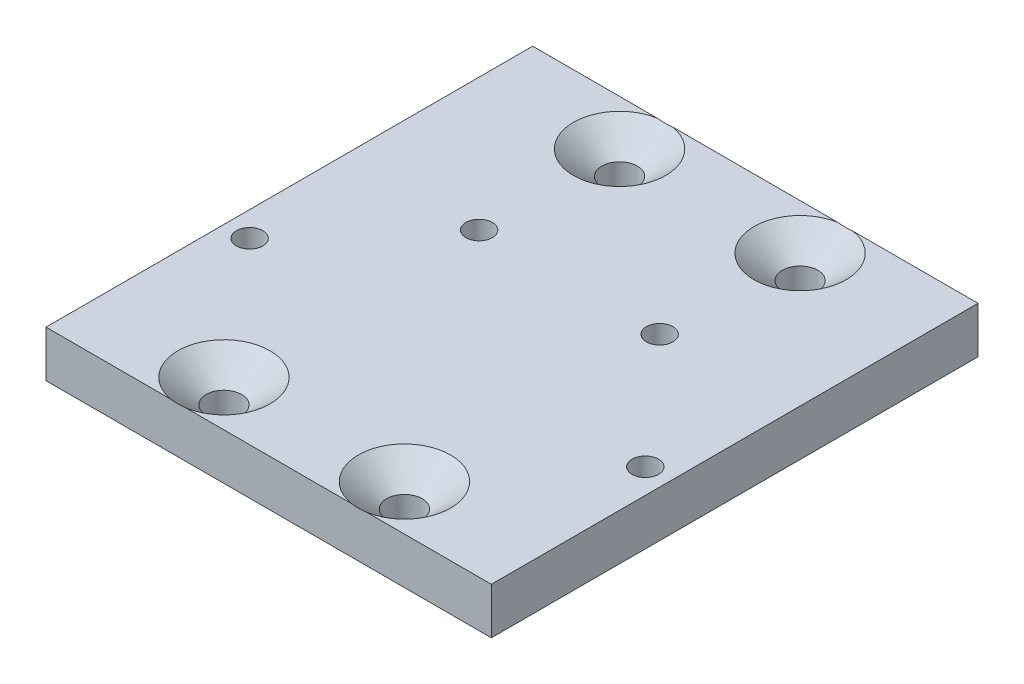
ISO-10303-21;
HEADER;
FILE_DESCRIPTION(('STEP AP214'),'2;1');
FILE_NAME('part.step','',(''),(''),'','','');
FILE_SCHEMA(('AUTOMOTIVE_DESIGN { 1 0 10303 214 1 1 1 1 }'));
ENDSEC;
DATA;
#1=APPLICATION_CONTEXT('core data for automotive mechanical design processes');
#2=APPLICATION_PROTOCOL_DEFINITION('international standard','automotive_design',2000,#1);
#3=PRODUCT_CONTEXT('',#1,'mechanical');
#4=PRODUCT('Part','Part','',(#3));
#5=PRODUCT_RELATED_PRODUCT_CATEGORY('part','',(#4));
#6=PRODUCT_DEFINITION_FORMATION('','',#4);
#7=PRODUCT_DEFINITION_CONTEXT('part definition',#1,'design');
#8=PRODUCT_DEFINITION('design','',#6,#7);
#9=PRODUCT_DEFINITION_SHAPE('','',#8);
#10=(LENGTH_UNIT() NAMED_UNIT(*) SI_UNIT(.MILLI.,.METRE.));
#11=(NAMED_UNIT(*) PLANE_ANGLE_UNIT() SI_UNIT($,.RADIAN.));
#12=(NAMED_UNIT(*) SI_UNIT($,.STERADIAN.) SOLID_ANGLE_UNIT());
#13=UNCERTAINTY_MEASURE_WITH_UNIT(LENGTH_MEASURE(1.E-05),#10,'distance_accuracy_value','');
#14=(GEOMETRIC_REPRESENTATION_CONTEXT(3) GLOBAL_UNCERTAINTY_ASSIGNED_CONTEXT((#13)) GLOBAL_UNIT_ASSIGNED_CONTEXT((#10,
#11,#12)) REPRESENTATION_CONTEXT('',''));
#15=CARTESIAN_POINT('',(0.,0.,0.));
#16=DIRECTION('',(0.,0.,1.));
#17=DIRECTION('',(1.,0.,0.));
#18=AXIS2_PLACEMENT_3D('',#15,#16,#17);
#19=CARTESIAN_POINT('',(-1573.83247517424,-1995.2375,-2973.3422592993));
#20=DIRECTION('',(1.,0.,0.));
#21=DIRECTION('',(0.,0.,-1.));
#22=AXIS2_PLACEMENT_3D('',#19,#20,#21);
#23=PLANE('',#22);
#24=DIRECTION('',(0.,0.,1.));
#25=VECTOR('',#24,1.);
#26=CARTESIAN_POINT('',(-1573.83247517424,-2000.,-2973.3422592993));
#27=LINE('',#26,#25);
#28=CARTESIAN_POINT('',(-1573.83247517424,-2000.,-2973.3422592993));
#29=VERTEX_POINT('',#28);
#30=CARTESIAN_POINT('',(-1573.83247517424,-2000.,-2923.3550592993));
#31=VERTEX_POINT('',#30);
#32=EDGE_CURVE('E186',#29,#31,#27,.T.);
#33=ORIENTED_EDGE('',*,*,#32,.T.);
#34=DIRECTION('',(0.,-1.,0.));
#35=VECTOR('',#34,1.);
#36=CARTESIAN_POINT('',(-1573.83247517424,-1995.2375,-2923.3550592993));
#37=LINE('',#36,#35);
#38=CARTESIAN_POINT('',(-1573.83247517424,-1995.2375,-2923.3550592993));
#39=VERTEX_POINT('',#38);
#40=EDGE_CURVE('E139',#39,#31,#37,.T.);
#41=ORIENTED_EDGE('',*,*,#40,.F.);
#42=DIRECTION('',(0.,0.,1.));
#43=VECTOR('',#42,1.);
#44=CARTESIAN_POINT('',(-1573.83247517424,-1995.2375,-2973.3422592993));
#45=LINE('',#44,#43);
#46=CARTESIAN_POINT('',(-1573.83247517424,-1995.2375,-2973.3422592993));
#47=VERTEX_POINT('',#46);
#48=EDGE_CURVE('E199',#47,#39,#45,.T.);
#49=ORIENTED_EDGE('',*,*,#48,.F.);
#50=DIRECTION('',(0.,-1.,0.));
#51=VECTOR('',#50,1.);
#52=CARTESIAN_POINT('',(-1573.83247517424,-1995.2375,-2973.3422592993));
#53=LINE('',#52,#51);
#54=EDGE_CURVE('E115',#47,#29,#53,.T.);
#55=ORIENTED_EDGE('',*,*,#54,.T.);
#56=EDGE_LOOP('',(#33,#41,#49,#55));
#57=FACE_BOUND('',#56,.T.);
#58=ADVANCED_FACE('F33',(#57),#23,.F.);
#59=CARTESIAN_POINT('',(-1573.83247517424,-1995.2375,-2923.3550592993));
#60=DIRECTION('',(0.,0.,-1.));
#61=DIRECTION('',(0.,1.,0.));
#62=AXIS2_PLACEMENT_3D('',#59,#60,#61);
#63=PLANE('',#62);
#64=DIRECTION('',(1.,0.,0.));
#65=VECTOR('',#64,1.);
#66=CARTESIAN_POINT('',(-1573.83247517424,-1995.2375,-2923.3550592993));
#67=LINE('',#66,#65);
#68=CARTESIAN_POINT('',(-1559.47015970523,-1995.2375,-2923.3550592993));
#69=VERTEX_POINT('',#68);
#70=CARTESIAN_POINT('',(-1542.44896440546,-1995.2375,-2923.3550592993));
#71=VERTEX_POINT('',#70);
#72=EDGE_CURVE('E203',#69,#71,#67,.T.);
#73=ORIENTED_EDGE('',*,*,#72,.F.);
#74=CARTESIAN_POINT('',(-1569.41358530349,-1990.56468048699,-2923.3550592993));
#75=CARTESIAN_POINT('',(-1569.21174421355,-1990.71560274366,-2923.3550592993));
#76=CARTESIAN_POINT('',(-1569.00942688799,-1990.86589320793,-2923.3550592993));
#77=CARTESIAN_POINT('',(-1568.60361527126,-1991.16490288206,-2923.3550592993));
#78=CARTESIAN_POINT('',(-1568.40012090627,-1991.31362199168,-2923.3550592993));
#79=CARTESIAN_POINT('',(-1567.99127915434,-1991.60950735567,-2923.3550592993));
#80=CARTESIAN_POINT('',(-1567.7859285486,-1991.75666916953,-2923.3550592993));
#81=CARTESIAN_POINT('',(-1567.37356854599,-1992.04864333607,-2923.3550592993));
#82=CARTESIAN_POINT('',(-1567.16655918772,-1992.19345574321,-2923.3550592993));
#83=CARTESIAN_POINT('',(-1566.74041587053,-1992.48713154743,-2923.3550592993));
#84=CARTESIAN_POINT('',(-1566.52118161438,-1992.6358497683,-2923.3550592993));
#85=CARTESIAN_POINT('',(-1566.07998760759,-1992.92918361001,-2923.3550592993));
#86=CARTESIAN_POINT('',(-1565.85802795152,-1993.07379937263,-2923.3550592993));
#87=CARTESIAN_POINT('',(-1565.41091390647,-1993.35756803673,-2923.3550592993));
#88=CARTESIAN_POINT('',(-1565.18576262875,-1993.49672581889,-2923.3550592993));
#89=CARTESIAN_POINT('',(-1564.73125197191,-1993.76795927597,-2923.3550592993));
#90=CARTESIAN_POINT('',(-1564.50189323368,-1993.90003601765,-2923.3550592993));
#91=CARTESIAN_POINT('',(-1564.04202878071,-1994.15236184947,-2923.3550592993));
#92=CARTESIAN_POINT('',(-1563.8116165971,-1994.27277996439,-2923.3550592993));
#93=CARTESIAN_POINT('',(-1563.34441558204,-1994.5010589324,-2923.3550592993));
#94=CARTESIAN_POINT('',(-1563.10762350435,-1994.60891323829,-2923.3550592993));
#95=CARTESIAN_POINT('',(-1562.6295392873,-1994.80602783005,-2923.3550592993));
#96=CARTESIAN_POINT('',(-1562.38833179826,-1994.89549023697,-2923.3550592993));
#97=CARTESIAN_POINT('',(-1561.89861100487,-1995.05109294031,-2923.3550592993));
#98=CARTESIAN_POINT('',(-1561.65010945367,-1995.11726874052,-2923.3550592993));
#99=CARTESIAN_POINT('',(-1561.29331100866,-1995.18987244124,-2923.3550592993));
#100=CARTESIAN_POINT('',(-1561.18748172429,-1995.20867064129,-2923.3550592993));
#101=CARTESIAN_POINT('',(-1560.97485251813,-1995.24061926715,-2923.3550592993));
#102=CARTESIAN_POINT('',(-1560.86805168783,-1995.25376369635,-2923.3550592993));
#103=CARTESIAN_POINT('',(-1560.60223798858,-1995.27890725842,-2923.3550592993));
#104=CARTESIAN_POINT('',(-1560.44286670045,-1995.28730184813,-2923.3550592993));
#105=CARTESIAN_POINT('',(-1560.12394991867,-1995.29033100045,-2923.3550592993));
#106=CARTESIAN_POINT('',(-1559.96440438489,-1995.28496101989,-2923.3550592993));
#107=CARTESIAN_POINT('',(-1559.64612845217,-1995.2607655726,-2923.3550592993));
#108=CARTESIAN_POINT('',(-1559.48739948185,-1995.24192154857,-2923.3550592993));
#109=CARTESIAN_POINT('',(-1559.17193971469,-1995.19182549488,-2923.3550592993));
#110=CARTESIAN_POINT('',(-1559.01520908869,-1995.1605724115,-2923.3550592993));
#111=CARTESIAN_POINT('',(-1558.60877570773,-1995.06458512429,-2923.3550592993));
#112=CARTESIAN_POINT('',(-1558.36114591104,-1994.99107930825,-2923.3550592993));
#113=CARTESIAN_POINT('',(-1557.87334822123,-1994.82247643454,-2923.3550592993));
#114=CARTESIAN_POINT('',(-1557.63318724683,-1994.72735999771,-2923.3550592993));
#115=CARTESIAN_POINT('',(-1557.27670875501,-1994.57224914023,-2923.3550592993));
#116=CARTESIAN_POINT('',(-1557.15778713767,-1994.51809897009,-2923.3550592993));
#117=CARTESIAN_POINT('',(-1556.92157463086,-1994.40634088791,-2923.3550592993));
#118=CARTESIAN_POINT('',(-1556.80428376328,-1994.3487329295,-2923.3550592993));
#119=CARTESIAN_POINT('',(-1556.57124854974,-1994.23060781532,-2923.3550592993));
#120=CARTESIAN_POINT('',(-1556.45550354027,-1994.17009196254,-2923.3550592993));
#121=CARTESIAN_POINT('',(-1556.22537075391,-1994.046552014,-2923.3550592993));
#122=CARTESIAN_POINT('',(-1556.11098291356,-1993.98352803611,-2923.3550592993));
#123=CARTESIAN_POINT('',(-1555.71346649151,-1993.75961696861,-2923.3550592993));
#124=CARTESIAN_POINT('',(-1555.43347654348,-1993.59315211366,-2923.3550592993));
#125=CARTESIAN_POINT('',(-1554.87915926296,-1993.25101203233,-2923.3550592993));
#126=CARTESIAN_POINT('',(-1554.60483337495,-1993.07533449597,-2923.3550592993));
#127=CARTESIAN_POINT('',(-1554.06031898442,-1992.71723119227,-2923.3550592993));
#128=CARTESIAN_POINT('',(-1553.79013401069,-1992.53480007764,-2923.3550592993));
#129=CARTESIAN_POINT('',(-1553.25315831184,-1992.16508428558,-2923.3550592993));
#130=CARTESIAN_POINT('',(-1552.98636726128,-1991.97780007883,-2923.3550592993));
#131=CARTESIAN_POINT('',(-1552.4545643664,-1991.59893966221,-2923.3550592993));
#132=CARTESIAN_POINT('',(-1552.18956098011,-1991.40735160679,-2923.3550592993));
#133=CARTESIAN_POINT('',(-1551.66164723604,-1991.0213072496,-2923.3550592993));
#134=CARTESIAN_POINT('',(-1551.39873692184,-1990.82685088833,-2923.3550592993));
#135=CARTESIAN_POINT('',(-1550.8747231946,-1990.43577386999,-2923.3550592993));
#136=CARTESIAN_POINT('',(-1550.61361899904,-1990.2391542601,-2923.3550592993));
#137=CARTESIAN_POINT('',(-1550.09278102018,-1989.84410721307,-2923.3550592993));
#138=CARTESIAN_POINT('',(-1549.83304724468,-1989.64567976564,-2923.3550592993));
#139=CARTESIAN_POINT('',(-1549.11590763138,-1989.09460396744,-2923.3550592993));
#140=CARTESIAN_POINT('',(-1548.65969284172,-1988.74040610206,-2923.3550592993));
#141=CARTESIAN_POINT('',(-1547.74974769175,-1988.0287160215,-2923.3550592993));
#142=CARTESIAN_POINT('',(-1547.29601767124,-1987.67122337284,-2923.3550592993));
#143=CARTESIAN_POINT('',(-1546.39321394907,-1986.9560177113,-2923.3550592993));
#144=CARTESIAN_POINT('',(-1545.94412870899,-1986.59831924944,-2923.3550592993));
#145=CARTESIAN_POINT('',(-1545.04749834999,-1985.88113958832,-2923.3550592993));
#146=CARTESIAN_POINT('',(-1544.5999530016,-1985.52165867608,-2923.3550592993));
#147=CARTESIAN_POINT('',(-1544.15293727668,-1985.16152510702,-2923.3550592993));
#148=B_SPLINE_CURVE_WITH_KNOTS('',3,(#74,#75,#76,#77,#78,#79,#80,#81,#82,#83,#84,#85,#86,#87,
#88,#89,#90,#91,#92,#93,#94,#95,#96,#97,#98,#99,#100,#101,#102,#103,#104,#105,#106,#107,#108,
#109,#110,#111,#112,#113,#114,#115,#116,#117,#118,#119,#120,#121,#122,#123,#124,#125,#126,#127,
#128,#129,#130,#131,#132,#133,#134,#135,#136,#137,#138,#139,#140,#141,#142,#143,#144,#145,#146,
#147),.UNSPECIFIED.,.F.,.F.,(4,2,2,2,2,2,2,2,2,2,2,2,2,2,2,2,2,2,2,2,2,2,2,2,2,2,2,2,2,2,2,2,2,
2,2,2,4),(0.,0.756082804054443,1.51221354878371,2.270111112952,3.02799108769648,
3.82270502819066,4.61739147152325,5.41135028180275,6.20518914460501,6.98485979159212,
7.76493493668921,8.53591546432079,9.30571537560242,9.62804356839515,9.95071279678353,
10.4288792568585,10.9072035618789,11.3861879174698,11.8652129552154,12.6387009501973,
13.4128853217042,13.8048504043538,14.1968207444533,14.5886170583121,14.9803949811771,
15.9573068698065,16.9344648918492,17.9124138816392,18.8902683767268,19.8712611524333,
20.8522743014595,21.8328318055918,22.8133948899122,24.5460840330911,26.2790044972737,
28.0013903296965,29.7235072894725),.UNSPECIFIED.);
#149=CARTESIAN_POINT('',(-1560.99096440546,-1995.2375,-2923.3550592993));
#150=VERTEX_POINT('',#149);
#151=EDGE_CURVE('E45',#69,#150,#148,.F.);
#152=ORIENTED_EDGE('',*,*,#151,.T.);
#153=EDGE_CURVE('E120',#39,#150,#67,.T.);
#154=ORIENTED_EDGE('',*,*,#153,.F.);
#155=ORIENTED_EDGE('',*,*,#40,.T.);
#156=DIRECTION('',(1.,0.,0.));
#157=VECTOR('',#156,1.);
#158=CARTESIAN_POINT('',(-1573.83247517424,-2000.,-2923.3550592993));
#159=LINE('',#158,#157);
#160=CARTESIAN_POINT('',(-1528.08664893645,-2000.,-2923.3550592993));
#161=VERTEX_POINT('',#160);
#162=EDGE_CURVE('E189',#31,#161,#159,.T.);
#163=ORIENTED_EDGE('',*,*,#162,.T.);
#164=DIRECTION('',(0.,-1.,0.));
#165=VECTOR('',#164,1.);
#166=CARTESIAN_POINT('',(-1528.08664893645,-1995.2375,-2923.3550592993));
#167=LINE('',#166,#165);
#168=CARTESIAN_POINT('',(-1528.08664893645,-1995.2375,-2923.3550592993));
#169=VERTEX_POINT('',#168);
#170=EDGE_CURVE('E131',#169,#161,#167,.T.);
#171=ORIENTED_EDGE('',*,*,#170,.F.);
#172=CARTESIAN_POINT('',(-1540.92815970523,-1995.2375,-2923.3550592993));
#173=VERTEX_POINT('',#172);
#174=EDGE_CURVE('E200',#173,#169,#67,.T.);
#175=ORIENTED_EDGE('',*,*,#174,.F.);
#176=CARTESIAN_POINT('',(-1550.87158530349,-1990.56468048699,-2923.3550592993));
#177=CARTESIAN_POINT('',(-1550.66974421355,-1990.71560274366,-2923.3550592993));
#178=CARTESIAN_POINT('',(-1550.46742688799,-1990.86589320793,-2923.3550592993));
#179=CARTESIAN_POINT('',(-1550.06161527126,-1991.16490288206,-2923.3550592993));
#180=CARTESIAN_POINT('',(-1549.85812090627,-1991.31362199168,-2923.3550592993));
#181=CARTESIAN_POINT('',(-1549.44927915434,-1991.60950735567,-2923.3550592993));
#182=CARTESIAN_POINT('',(-1549.2439285486,-1991.75666916953,-2923.3550592993));
#183=CARTESIAN_POINT('',(-1548.83156854599,-1992.04864333607,-2923.3550592993));
#184=CARTESIAN_POINT('',(-1548.62455918772,-1992.19345574321,-2923.3550592993));
#185=CARTESIAN_POINT('',(-1548.19841587053,-1992.48713154743,-2923.3550592993));
#186=CARTESIAN_POINT('',(-1547.97918161438,-1992.6358497683,-2923.3550592993));
#187=CARTESIAN_POINT('',(-1547.53798760759,-1992.92918361001,-2923.3550592993));
#188=CARTESIAN_POINT('',(-1547.31602795152,-1993.07379937263,-2923.3550592993));
#189=CARTESIAN_POINT('',(-1546.86891390647,-1993.35756803673,-2923.3550592993));
#190=CARTESIAN_POINT('',(-1546.64376262875,-1993.49672581889,-2923.3550592993));
#191=CARTESIAN_POINT('',(-1546.18925197191,-1993.76795927597,-2923.3550592993));
#192=CARTESIAN_POINT('',(-1545.95989323368,-1993.90003601765,-2923.3550592993));
#193=CARTESIAN_POINT('',(-1545.50002878071,-1994.15236184947,-2923.3550592993));
#194=CARTESIAN_POINT('',(-1545.2696165971,-1994.27277996439,-2923.3550592993));
#195=CARTESIAN_POINT('',(-1544.80241558204,-1994.5010589324,-2923.3550592993));
#196=CARTESIAN_POINT('',(-1544.56562350435,-1994.60891323829,-2923.3550592993));
#197=CARTESIAN_POINT('',(-1544.0875392873,-1994.80602783005,-2923.3550592993));
#198=CARTESIAN_POINT('',(-1543.84633179826,-1994.89549023697,-2923.3550592993));
#199=CARTESIAN_POINT('',(-1543.35661100487,-1995.05109294031,-2923.3550592993));
#200=CARTESIAN_POINT('',(-1543.10810945367,-1995.11726874052,-2923.3550592993));
#201=CARTESIAN_POINT('',(-1542.75131100866,-1995.18987244124,-2923.3550592993));
#202=CARTESIAN_POINT('',(-1542.64548172429,-1995.20867064129,-2923.3550592993));
#203=CARTESIAN_POINT('',(-1542.43285251813,-1995.24061926715,-2923.3550592993));
#204=CARTESIAN_POINT('',(-1542.32605168783,-1995.25376369635,-2923.3550592993));
#205=CARTESIAN_POINT('',(-1542.06023798858,-1995.27890725842,-2923.3550592993));
#206=CARTESIAN_POINT('',(-1541.90086670045,-1995.28730184813,-2923.3550592993));
#207=CARTESIAN_POINT('',(-1541.58194991867,-1995.29033100045,-2923.3550592993));
#208=CARTESIAN_POINT('',(-1541.42240438489,-1995.28496101989,-2923.3550592993));
#209=CARTESIAN_POINT('',(-1541.10412845217,-1995.2607655726,-2923.3550592993));
#210=CARTESIAN_POINT('',(-1540.94539948185,-1995.24192154857,-2923.3550592993));
#211=CARTESIAN_POINT('',(-1540.62993971469,-1995.19182549488,-2923.3550592993));
#212=CARTESIAN_POINT('',(-1540.47320908869,-1995.1605724115,-2923.3550592993));
#213=CARTESIAN_POINT('',(-1540.06677570773,-1995.06458512429,-2923.3550592993));
#214=CARTESIAN_POINT('',(-1539.81914591104,-1994.99107930825,-2923.3550592993));
#215=CARTESIAN_POINT('',(-1539.33134822123,-1994.82247643454,-2923.3550592993));
#216=CARTESIAN_POINT('',(-1539.09118724683,-1994.72735999771,-2923.3550592993));
#217=CARTESIAN_POINT('',(-1538.73470875501,-1994.57224914023,-2923.3550592993));
#218=CARTESIAN_POINT('',(-1538.61578713767,-1994.51809897009,-2923.3550592993));
#219=CARTESIAN_POINT('',(-1538.37957463086,-1994.40634088791,-2923.3550592993));
#220=CARTESIAN_POINT('',(-1538.26228376328,-1994.3487329295,-2923.3550592993));
#221=CARTESIAN_POINT('',(-1538.02924854974,-1994.23060781532,-2923.3550592993));
#222=CARTESIAN_POINT('',(-1537.91350354027,-1994.17009196254,-2923.3550592993));
#223=CARTESIAN_POINT('',(-1537.68337075391,-1994.046552014,-2923.3550592993));
#224=CARTESIAN_POINT('',(-1537.56898291356,-1993.98352803611,-2923.3550592993));
#225=CARTESIAN_POINT('',(-1537.17146649151,-1993.75961696861,-2923.3550592993));
#226=CARTESIAN_POINT('',(-1536.89147654348,-1993.59315211366,-2923.3550592993));
#227=CARTESIAN_POINT('',(-1536.33715926296,-1993.25101203233,-2923.3550592993));
#228=CARTESIAN_POINT('',(-1536.06283337495,-1993.07533449597,-2923.3550592993));
#229=CARTESIAN_POINT('',(-1535.51831898442,-1992.71723119227,-2923.3550592993));
#230=CARTESIAN_POINT('',(-1535.24813401069,-1992.53480007764,-2923.3550592993));
#231=CARTESIAN_POINT('',(-1534.71115831184,-1992.16508428558,-2923.3550592993));
#232=CARTESIAN_POINT('',(-1534.44436726128,-1991.97780007883,-2923.3550592993));
#233=CARTESIAN_POINT('',(-1533.91256436639,-1991.59893966221,-2923.3550592993));
#234=CARTESIAN_POINT('',(-1533.64756098011,-1991.40735160679,-2923.3550592993));
#235=CARTESIAN_POINT('',(-1533.11964723604,-1991.0213072496,-2923.3550592993));
#236=CARTESIAN_POINT('',(-1532.85673692184,-1990.82685088833,-2923.3550592993));
#237=CARTESIAN_POINT('',(-1532.3327231946,-1990.43577386999,-2923.3550592993));
#238=CARTESIAN_POINT('',(-1532.07161899904,-1990.2391542601,-2923.3550592993));
#239=CARTESIAN_POINT('',(-1531.55078102018,-1989.84410721307,-2923.3550592993));
#240=CARTESIAN_POINT('',(-1531.29104724468,-1989.64567976564,-2923.3550592993));
#241=CARTESIAN_POINT('',(-1530.57390763138,-1989.09460396744,-2923.3550592993));
#242=CARTESIAN_POINT('',(-1530.11769284172,-1988.74040610206,-2923.3550592993));
#243=CARTESIAN_POINT('',(-1529.20774769175,-1988.0287160215,-2923.3550592993));
#244=CARTESIAN_POINT('',(-1528.75401767124,-1987.67122337284,-2923.3550592993));
#245=CARTESIAN_POINT('',(-1527.85121394907,-1986.9560177113,-2923.3550592993));
#246=CARTESIAN_POINT('',(-1527.40212870899,-1986.59831924944,-2923.3550592993));
#247=CARTESIAN_POINT('',(-1526.50549834999,-1985.88113958832,-2923.3550592993));
#248=CARTESIAN_POINT('',(-1526.0579530016,-1985.52165867608,-2923.3550592993));
#249=CARTESIAN_POINT('',(-1525.61093727668,-1985.16152510702,-2923.3550592993));
#250=B_SPLINE_CURVE_WITH_KNOTS('',3,(#176,#177,#178,#179,#180,#181,#182,#183,#184,#185,#186,
#187,#188,#189,#190,#191,#192,#193,#194,#195,#196,#197,#198,#199,#200,#201,#202,#203,#204,#205,
#206,#207,#208,#209,#210,#211,#212,#213,#214,#215,#216,#217,#218,#219,#220,#221,#222,#223,#224,
#225,#226,#227,#228,#229,#230,#231,#232,#233,#234,#235,#236,#237,#238,#239,#240,#241,#242,#243,
#244,#245,#246,#247,#248,#249),.UNSPECIFIED.,.F.,.F.,(4,2,2,2,2,2,2,2,2,2,2,2,2,2,2,2,2,2,2,2,2,
2,2,2,2,2,2,2,2,2,2,2,2,2,2,2,4),(0.,0.756082804054443,1.51221354878371,2.270111112952,
3.02799108769648,3.82270502819066,4.61739147152325,5.41135028180275,6.20518914460501,
6.98485979159212,7.76493493668921,8.53591546432079,9.30571537560242,9.62804356839515,
9.95071279678353,10.4288792568585,10.9072035618789,11.3861879174698,11.8652129552154,
12.6387009501973,13.4128853217042,13.8048504043538,14.1968207444533,14.5886170583121,
14.9803949811771,15.9573068698065,16.9344648918492,17.9124138816392,18.8902683767268,
19.8712611524333,20.8522743014595,21.8328318055918,22.8133948899122,24.5460840330911,
26.2790044972737,28.0013903296965,29.7235072894725),.UNSPECIFIED.);
#251=EDGE_CURVE('E149',#173,#71,#250,.F.);
#252=ORIENTED_EDGE('',*,*,#251,.T.);
#253=EDGE_LOOP('',(#73,#152,#154,#155,#163,#171,#175,#252));
#254=FACE_BOUND('',#253,.T.);
#255=ADVANCED_FACE('F179',(#254),#63,.F.);
#256=CARTESIAN_POINT('',(-1528.08664893645,-1995.2375,-2973.3422592993));
#257=DIRECTION('',(-1.,0.,0.));
#258=DIRECTION('',(0.,0.,1.));
#259=AXIS2_PLACEMENT_3D('',#256,#257,#258);
#260=PLANE('',#259);
#261=DIRECTION('',(0.,0.,-1.));
#262=VECTOR('',#261,1.);
#263=CARTESIAN_POINT('',(-1528.08664893645,-2000.,-2973.3422592993));
#264=LINE('',#263,#262);
#265=CARTESIAN_POINT('',(-1528.08664893645,-2000.,-2973.3422592993));
#266=VERTEX_POINT('',#265);
#267=EDGE_CURVE('E191',#161,#266,#264,.T.);
#268=ORIENTED_EDGE('',*,*,#267,.T.);
#269=DIRECTION('',(0.,-1.,0.));
#270=VECTOR('',#269,1.);
#271=CARTESIAN_POINT('',(-1528.08664893645,-1995.2375,-2973.3422592993));
#272=LINE('',#271,#270);
#273=CARTESIAN_POINT('',(-1528.08664893645,-1995.2375,-2973.3422592993));
#274=VERTEX_POINT('',#273);
#275=EDGE_CURVE('E125',#274,#266,#272,.T.);
#276=ORIENTED_EDGE('',*,*,#275,.F.);
#277=DIRECTION('',(0.,0.,-1.));
#278=VECTOR('',#277,1.);
#279=CARTESIAN_POINT('',(-1528.08664893645,-1995.2375,-2973.3422592993));
#280=LINE('',#279,#278);
#281=EDGE_CURVE('E117',#169,#274,#280,.T.);
#282=ORIENTED_EDGE('',*,*,#281,.F.);
#283=ORIENTED_EDGE('',*,*,#170,.T.);
#284=EDGE_LOOP('',(#268,#276,#282,#283));
#285=FACE_BOUND('',#284,.T.);
#286=ADVANCED_FACE('F183',(#285),#260,.F.);
#287=CARTESIAN_POINT('',(-1573.83247517424,-1995.2375,-2973.3422592993));
#288=DIRECTION('',(0.,0.,1.));
#289=DIRECTION('',(0.,-1.,0.));
#290=AXIS2_PLACEMENT_3D('',#287,#288,#289);
#291=PLANE('',#290);
#292=DIRECTION('',(-1.,0.,0.));
#293=VECTOR('',#292,1.);
#294=CARTESIAN_POINT('',(-1573.83247517424,-1995.2375,-2973.3422592993));
#295=LINE('',#294,#293);
#296=CARTESIAN_POINT('',(-1560.99096440546,-1995.2375,-2973.3422592993));
#297=VERTEX_POINT('',#296);
#298=EDGE_CURVE('E106',#297,#47,#295,.T.);
#299=ORIENTED_EDGE('',*,*,#298,.F.);
#300=CARTESIAN_POINT('',(-1569.4135853035,-1990.56468048698,-2973.3422592993));
#301=CARTESIAN_POINT('',(-1569.21174421355,-1990.71560274365,-2973.3422592993));
#302=CARTESIAN_POINT('',(-1569.009426888,-1990.86589320792,-2973.3422592993));
#303=CARTESIAN_POINT('',(-1568.60361527126,-1991.16490288205,-2973.3422592993));
#304=CARTESIAN_POINT('',(-1568.40012090627,-1991.31362199168,-2973.3422592993));
#305=CARTESIAN_POINT('',(-1567.99127915435,-1991.60950735566,-2973.3422592993));
#306=CARTESIAN_POINT('',(-1567.78592854861,-1991.75666916952,-2973.3422592993));
#307=CARTESIAN_POINT('',(-1567.37356854599,-1992.04864333607,-2973.3422592993));
#308=CARTESIAN_POINT('',(-1567.16655918773,-1992.1934557432,-2973.3422592993));
#309=CARTESIAN_POINT('',(-1566.74041587054,-1992.48713154742,-2973.3422592993));
#310=CARTESIAN_POINT('',(-1566.52118161438,-1992.63584976829,-2973.3422592993));
#311=CARTESIAN_POINT('',(-1566.07998760759,-1992.92918361001,-2973.3422592993));
#312=CARTESIAN_POINT('',(-1565.85802795152,-1993.07379937263,-2973.3422592993));
#313=CARTESIAN_POINT('',(-1565.41091390647,-1993.35756803673,-2973.3422592993));
#314=CARTESIAN_POINT('',(-1565.18576262875,-1993.49672581889,-2973.3422592993));
#315=CARTESIAN_POINT('',(-1564.73125197192,-1993.76795927597,-2973.3422592993));
#316=CARTESIAN_POINT('',(-1564.50189323368,-1993.90003601764,-2973.3422592993));
#317=CARTESIAN_POINT('',(-1564.04202878071,-1994.15236184947,-2973.3422592993));
#318=CARTESIAN_POINT('',(-1563.8116165971,-1994.27277996439,-2973.3422592993));
#319=CARTESIAN_POINT('',(-1563.34441558204,-1994.5010589324,-2973.3422592993));
#320=CARTESIAN_POINT('',(-1563.10762350436,-1994.60891323829,-2973.3422592993));
#321=CARTESIAN_POINT('',(-1562.6295392873,-1994.80602783005,-2973.3422592993));
#322=CARTESIAN_POINT('',(-1562.38833179826,-1994.89549023697,-2973.3422592993));
#323=CARTESIAN_POINT('',(-1561.89861100487,-1995.05109294031,-2973.3422592993));
#324=CARTESIAN_POINT('',(-1561.65010945367,-1995.11726874052,-2973.3422592993));
#325=CARTESIAN_POINT('',(-1561.29331100866,-1995.18987244124,-2973.3422592993));
#326=CARTESIAN_POINT('',(-1561.18748172429,-1995.20867064129,-2973.3422592993));
#327=CARTESIAN_POINT('',(-1560.97485251813,-1995.24061926715,-2973.3422592993));
#328=CARTESIAN_POINT('',(-1560.86805168783,-1995.25376369635,-2973.3422592993));
#329=CARTESIAN_POINT('',(-1560.60223798858,-1995.27890725842,-2973.3422592993));
#330=CARTESIAN_POINT('',(-1560.44286670045,-1995.28730184813,-2973.3422592993));
#331=CARTESIAN_POINT('',(-1560.12394991867,-1995.29033100045,-2973.3422592993));
#332=CARTESIAN_POINT('',(-1559.96440438489,-1995.28496101989,-2973.3422592993));
#333=CARTESIAN_POINT('',(-1559.64612845217,-1995.2607655726,-2973.3422592993));
#334=CARTESIAN_POINT('',(-1559.48739948185,-1995.24192154857,-2973.3422592993));
#335=CARTESIAN_POINT('',(-1559.17193971469,-1995.19182549488,-2973.3422592993));
#336=CARTESIAN_POINT('',(-1559.01520908869,-1995.1605724115,-2973.3422592993));
#337=CARTESIAN_POINT('',(-1558.60877570773,-1995.06458512429,-2973.3422592993));
#338=CARTESIAN_POINT('',(-1558.36114591104,-1994.99107930825,-2973.3422592993));
#339=CARTESIAN_POINT('',(-1557.87334822123,-1994.82247643454,-2973.3422592993));
#340=CARTESIAN_POINT('',(-1557.63318724683,-1994.72735999771,-2973.3422592993));
#341=CARTESIAN_POINT('',(-1557.27670875501,-1994.57224914023,-2973.3422592993));
#342=CARTESIAN_POINT('',(-1557.15778713767,-1994.51809897009,-2973.3422592993));
#343=CARTESIAN_POINT('',(-1556.92157463087,-1994.40634088791,-2973.3422592993));
#344=CARTESIAN_POINT('',(-1556.80428376329,-1994.3487329295,-2973.3422592993));
#345=CARTESIAN_POINT('',(-1556.57124854974,-1994.23060781532,-2973.3422592993));
#346=CARTESIAN_POINT('',(-1556.45550354027,-1994.17009196254,-2973.3422592993));
#347=CARTESIAN_POINT('',(-1556.22537075391,-1994.046552014,-2973.3422592993));
#348=CARTESIAN_POINT('',(-1556.11098291356,-1993.98352803611,-2973.3422592993));
#349=CARTESIAN_POINT('',(-1555.71346649151,-1993.75961696861,-2973.3422592993));
#350=CARTESIAN_POINT('',(-1555.43347654348,-1993.59315211366,-2973.3422592993));
#351=CARTESIAN_POINT('',(-1554.87915926297,-1993.25101203233,-2973.3422592993));
#352=CARTESIAN_POINT('',(-1554.60483337495,-1993.07533449597,-2973.3422592993));
#353=CARTESIAN_POINT('',(-1554.06031898442,-1992.71723119227,-2973.3422592993));
#354=CARTESIAN_POINT('',(-1553.79013401069,-1992.53480007764,-2973.3422592993));
#355=CARTESIAN_POINT('',(-1553.25315831184,-1992.16508428558,-2973.3422592993));
#356=CARTESIAN_POINT('',(-1552.98636726128,-1991.97780007883,-2973.3422592993));
#357=CARTESIAN_POINT('',(-1552.4545643664,-1991.59893966221,-2973.3422592993));
#358=CARTESIAN_POINT('',(-1552.18956098011,-1991.4073516068,-2973.3422592993));
#359=CARTESIAN_POINT('',(-1551.66164723604,-1991.0213072496,-2973.3422592993));
#360=CARTESIAN_POINT('',(-1551.39873692184,-1990.82685088833,-2973.3422592993));
#361=CARTESIAN_POINT('',(-1550.8747231946,-1990.43577386999,-2973.3422592993));
#362=CARTESIAN_POINT('',(-1550.61361899904,-1990.2391542601,-2973.3422592993));
#363=CARTESIAN_POINT('',(-1550.09278102018,-1989.84410721307,-2973.3422592993));
#364=CARTESIAN_POINT('',(-1549.83304724469,-1989.64567976565,-2973.3422592993));
#365=CARTESIAN_POINT('',(-1549.11590763138,-1989.09460396745,-2973.3422592993));
#366=CARTESIAN_POINT('',(-1548.65969284172,-1988.74040610206,-2973.3422592993));
#367=CARTESIAN_POINT('',(-1547.74974769175,-1988.0287160215,-2973.3422592993));
#368=CARTESIAN_POINT('',(-1547.29601767124,-1987.67122337284,-2973.3422592993));
#369=CARTESIAN_POINT('',(-1546.39321394907,-1986.9560177113,-2973.3422592993));
#370=CARTESIAN_POINT('',(-1545.94412870899,-1986.59831924944,-2973.3422592993));
#371=CARTESIAN_POINT('',(-1545.04749835,-1985.88113958832,-2973.3422592993));
#372=CARTESIAN_POINT('',(-1544.59995300161,-1985.52165867608,-2973.3422592993));
#373=CARTESIAN_POINT('',(-1544.15293727668,-1985.16152510702,-2973.3422592993));
#374=B_SPLINE_CURVE_WITH_KNOTS('',3,(#300,#301,#302,#303,#304,#305,#306,#307,#308,#309,#310,
#311,#312,#313,#314,#315,#316,#317,#318,#319,#320,#321,#322,#323,#324,#325,#326,#327,#328,#329,
#330,#331,#332,#333,#334,#335,#336,#337,#338,#339,#340,#341,#342,#343,#344,#345,#346,#347,#348,
#349,#350,#351,#352,#353,#354,#355,#356,#357,#358,#359,#360,#361,#362,#363,#364,#365,#366,#367,
#368,#369,#370,#371,#372,#373),.UNSPECIFIED.,.F.,.F.,(4,2,2,2,2,2,2,2,2,2,2,2,2,2,2,2,2,2,2,2,2,
2,2,2,2,2,2,2,2,2,2,2,2,2,2,2,4),(0.,0.756082804055553,1.51221354878562,2.27011111295466,
3.02799108770025,3.82270502819516,4.61739147152874,5.41135028180905,6.2051891446126,
6.98485979160021,7.7649349366973,8.53591546432895,9.30571537561166,9.62804356840399,
9.9507127967919,10.4288792568669,10.9072035618872,11.3861879174782,11.8652129552235,
12.6387009502054,13.4128853217116,13.8048504043612,14.1968207444605,14.5886170583191,
14.9803949811844,15.9573068698132,16.9344648918556,17.9124138816453,18.8902683767325,
19.8712611524383,20.8522743014642,21.832831805596,22.8133948899163,24.5460840330948,
26.2790044972768,28.0013903296989,29.7235072894744),.UNSPECIFIED.);
#375=CARTESIAN_POINT('',(-1559.47015970524,-1995.2375,-2973.3422592993));
#376=VERTEX_POINT('',#375);
#377=EDGE_CURVE('E11',#297,#376,#374,.T.);
#378=ORIENTED_EDGE('',*,*,#377,.T.);
#379=CARTESIAN_POINT('',(-1542.44896440546,-1995.2375,-2973.3422592993));
#380=VERTEX_POINT('',#379);
#381=EDGE_CURVE('E109',#380,#376,#295,.T.);
#382=ORIENTED_EDGE('',*,*,#381,.F.);
#383=CARTESIAN_POINT('',(-1550.8715853035,-1990.56468048698,-2973.3422592993));
#384=CARTESIAN_POINT('',(-1550.66974421355,-1990.71560274365,-2973.3422592993));
#385=CARTESIAN_POINT('',(-1550.467426888,-1990.86589320792,-2973.3422592993));
#386=CARTESIAN_POINT('',(-1550.06161527126,-1991.16490288205,-2973.3422592993));
#387=CARTESIAN_POINT('',(-1549.85812090628,-1991.31362199168,-2973.3422592993));
#388=CARTESIAN_POINT('',(-1549.44927915435,-1991.60950735566,-2973.3422592993));
#389=CARTESIAN_POINT('',(-1549.24392854861,-1991.75666916952,-2973.3422592993));
#390=CARTESIAN_POINT('',(-1548.83156854599,-1992.04864333607,-2973.3422592993));
#391=CARTESIAN_POINT('',(-1548.62455918773,-1992.1934557432,-2973.3422592993));
#392=CARTESIAN_POINT('',(-1548.19841587054,-1992.48713154742,-2973.3422592993));
#393=CARTESIAN_POINT('',(-1547.97918161438,-1992.63584976829,-2973.3422592993));
#394=CARTESIAN_POINT('',(-1547.53798760759,-1992.92918361001,-2973.3422592993));
#395=CARTESIAN_POINT('',(-1547.31602795152,-1993.07379937263,-2973.3422592993));
#396=CARTESIAN_POINT('',(-1546.86891390647,-1993.35756803673,-2973.3422592993));
#397=CARTESIAN_POINT('',(-1546.64376262875,-1993.49672581889,-2973.3422592993));
#398=CARTESIAN_POINT('',(-1546.18925197192,-1993.76795927597,-2973.3422592993));
#399=CARTESIAN_POINT('',(-1545.95989323368,-1993.90003601764,-2973.3422592993));
#400=CARTESIAN_POINT('',(-1545.50002878071,-1994.15236184947,-2973.3422592993));
#401=CARTESIAN_POINT('',(-1545.2696165971,-1994.27277996439,-2973.3422592993));
#402=CARTESIAN_POINT('',(-1544.80241558204,-1994.5010589324,-2973.3422592993));
#403=CARTESIAN_POINT('',(-1544.56562350436,-1994.60891323829,-2973.3422592993));
#404=CARTESIAN_POINT('',(-1544.0875392873,-1994.80602783005,-2973.3422592993));
#405=CARTESIAN_POINT('',(-1543.84633179826,-1994.89549023697,-2973.3422592993));
#406=CARTESIAN_POINT('',(-1543.35661100487,-1995.05109294031,-2973.3422592993));
#407=CARTESIAN_POINT('',(-1543.10810945367,-1995.11726874052,-2973.3422592993));
#408=CARTESIAN_POINT('',(-1542.75131100866,-1995.18987244124,-2973.3422592993));
#409=CARTESIAN_POINT('',(-1542.64548172429,-1995.20867064129,-2973.3422592993));
#410=CARTESIAN_POINT('',(-1542.43285251813,-1995.24061926715,-2973.3422592993));
#411=CARTESIAN_POINT('',(-1542.32605168783,-1995.25376369635,-2973.3422592993));
#412=CARTESIAN_POINT('',(-1542.06023798858,-1995.27890725842,-2973.3422592993));
#413=CARTESIAN_POINT('',(-1541.90086670045,-1995.28730184813,-2973.3422592993));
#414=CARTESIAN_POINT('',(-1541.58194991867,-1995.29033100045,-2973.3422592993));
#415=CARTESIAN_POINT('',(-1541.42240438489,-1995.28496101989,-2973.3422592993));
#416=CARTESIAN_POINT('',(-1541.10412845217,-1995.2607655726,-2973.3422592993));
#417=CARTESIAN_POINT('',(-1540.94539948185,-1995.24192154857,-2973.3422592993));
#418=CARTESIAN_POINT('',(-1540.62993971469,-1995.19182549488,-2973.3422592993));
#419=CARTESIAN_POINT('',(-1540.47320908869,-1995.1605724115,-2973.3422592993));
#420=CARTESIAN_POINT('',(-1540.06677570773,-1995.06458512429,-2973.3422592993));
#421=CARTESIAN_POINT('',(-1539.81914591104,-1994.99107930825,-2973.3422592993));
#422=CARTESIAN_POINT('',(-1539.33134822123,-1994.82247643454,-2973.3422592993));
#423=CARTESIAN_POINT('',(-1539.09118724683,-1994.72735999771,-2973.3422592993));
#424=CARTESIAN_POINT('',(-1538.73470875501,-1994.57224914023,-2973.3422592993));
#425=CARTESIAN_POINT('',(-1538.61578713768,-1994.51809897009,-2973.3422592993));
#426=CARTESIAN_POINT('',(-1538.37957463087,-1994.40634088791,-2973.3422592993));
#427=CARTESIAN_POINT('',(-1538.26228376329,-1994.3487329295,-2973.3422592993));
#428=CARTESIAN_POINT('',(-1538.02924854974,-1994.23060781532,-2973.3422592993));
#429=CARTESIAN_POINT('',(-1537.91350354027,-1994.17009196254,-2973.3422592993));
#430=CARTESIAN_POINT('',(-1537.68337075391,-1994.046552014,-2973.3422592993));
#431=CARTESIAN_POINT('',(-1537.56898291356,-1993.98352803611,-2973.3422592993));
#432=CARTESIAN_POINT('',(-1537.17146649151,-1993.75961696861,-2973.3422592993));
#433=CARTESIAN_POINT('',(-1536.89147654348,-1993.59315211366,-2973.3422592993));
#434=CARTESIAN_POINT('',(-1536.33715926297,-1993.25101203233,-2973.3422592993));
#435=CARTESIAN_POINT('',(-1536.06283337495,-1993.07533449597,-2973.3422592993));
#436=CARTESIAN_POINT('',(-1535.51831898442,-1992.71723119227,-2973.3422592993));
#437=CARTESIAN_POINT('',(-1535.24813401069,-1992.53480007764,-2973.3422592993));
#438=CARTESIAN_POINT('',(-1534.71115831184,-1992.16508428558,-2973.3422592993));
#439=CARTESIAN_POINT('',(-1534.44436726128,-1991.97780007883,-2973.3422592993));
#440=CARTESIAN_POINT('',(-1533.9125643664,-1991.59893966221,-2973.3422592993));
#441=CARTESIAN_POINT('',(-1533.64756098012,-1991.4073516068,-2973.3422592993));
#442=CARTESIAN_POINT('',(-1533.11964723605,-1991.0213072496,-2973.3422592993));
#443=CARTESIAN_POINT('',(-1532.85673692184,-1990.82685088833,-2973.3422592993));
#444=CARTESIAN_POINT('',(-1532.3327231946,-1990.43577386999,-2973.3422592993));
#445=CARTESIAN_POINT('',(-1532.07161899904,-1990.23915426011,-2973.3422592993));
#446=CARTESIAN_POINT('',(-1531.55078102018,-1989.84410721307,-2973.3422592993));
#447=CARTESIAN_POINT('',(-1531.29104724469,-1989.64567976565,-2973.3422592993));
#448=CARTESIAN_POINT('',(-1530.57390763138,-1989.09460396745,-2973.3422592993));
#449=CARTESIAN_POINT('',(-1530.11769284173,-1988.74040610206,-2973.3422592993));
#450=CARTESIAN_POINT('',(-1529.20774769175,-1988.02871602151,-2973.3422592993));
#451=CARTESIAN_POINT('',(-1528.75401767125,-1987.67122337284,-2973.3422592993));
#452=CARTESIAN_POINT('',(-1527.85121394907,-1986.9560177113,-2973.3422592993));
#453=CARTESIAN_POINT('',(-1527.402128709,-1986.59831924944,-2973.3422592993));
#454=CARTESIAN_POINT('',(-1526.50549835,-1985.88113958833,-2973.3422592993));
#455=CARTESIAN_POINT('',(-1526.05795300161,-1985.52165867608,-2973.3422592993));
#456=CARTESIAN_POINT('',(-1525.61093727668,-1985.16152510702,-2973.3422592993));
#457=B_SPLINE_CURVE_WITH_KNOTS('',3,(#383,#384,#385,#386,#387,#388,#389,#390,#391,#392,#393,
#394,#395,#396,#397,#398,#399,#400,#401,#402,#403,#404,#405,#406,#407,#408,#409,#410,#411,#412,
#413,#414,#415,#416,#417,#418,#419,#420,#421,#422,#423,#424,#425,#426,#427,#428,#429,#430,#431,
#432,#433,#434,#435,#436,#437,#438,#439,#440,#441,#442,#443,#444,#445,#446,#447,#448,#449,#450,
#451,#452,#453,#454,#455,#456),.UNSPECIFIED.,.F.,.F.,(4,2,2,2,2,2,2,2,2,2,2,2,2,2,2,2,2,2,2,2,2,
2,2,2,2,2,2,2,2,2,2,2,2,2,2,2,4),(0.,0.756082804055553,1.51221354878575,2.27011111295515,
3.02799108770105,3.82270502819633,4.61739147152985,5.41135028181065,6.2051891446142,
6.98485979160191,7.7649349366994,8.53591546433099,9.30571537561332,9.62804356840539,
9.95071279679308,10.4288792568681,10.9072035618886,11.3861879174796,11.8652129552249,
12.6387009502061,13.4128853217123,13.8048504043616,14.1968207444613,14.5886170583202,
14.9803949811852,15.957306869814,16.9344648918559,17.9124138816456,18.8902683767325,
19.8712611524386,20.8522743014641,21.8328318055959,22.8133948899158,24.5460840330939,
26.2790044972758,28.0013903296975,29.7235072894728),.UNSPECIFIED.);
#458=CARTESIAN_POINT('',(-1540.92815970524,-1995.2375,-2973.3422592993));
#459=VERTEX_POINT('',#458);
#460=EDGE_CURVE('E142',#380,#459,#457,.T.);
#461=ORIENTED_EDGE('',*,*,#460,.T.);
#462=EDGE_CURVE('E119',#274,#459,#295,.T.);
#463=ORIENTED_EDGE('',*,*,#462,.F.);
#464=ORIENTED_EDGE('',*,*,#275,.T.);
#465=DIRECTION('',(-1.,0.,0.));
#466=VECTOR('',#465,1.);
#467=CARTESIAN_POINT('',(-1573.83247517424,-2000.,-2973.3422592993));
#468=LINE('',#467,#466);
#469=EDGE_CURVE('E134',#266,#29,#468,.T.);
#470=ORIENTED_EDGE('',*,*,#469,.T.);
#471=ORIENTED_EDGE('',*,*,#54,.F.);
#472=EDGE_LOOP('',(#299,#378,#382,#461,#463,#464,#470,#471));
#473=FACE_BOUND('',#472,.T.);
#474=ADVANCED_FACE('F113',(#473),#291,.F.);
#475=CARTESIAN_POINT('',(0.,-1995.2375,0.));
#476=DIRECTION('',(0.,1.,0.));
#477=DIRECTION('',(0.,0.,1.));
#478=AXIS2_PLACEMENT_3D('',#475,#476,#477);
#479=PLANE('',#478);
#480=CARTESIAN_POINT('',(-1530.63331467783,-1995.2375,-2941.71468735724));
#481=DIRECTION('',(0.,-1.,0.));
#482=DIRECTION('',(0.,0.,-1.));
#483=AXIS2_PLACEMENT_3D('',#480,#481,#482);
#484=CIRCLE('',#483,1.35890000000007);
#485=CARTESIAN_POINT('',(-1530.63331467783,-1995.2375,-2943.07358735724));
#486=VERTEX_POINT('',#485);
#487=EDGE_CURVE('E404',#486,#486,#484,.T.);
#488=ORIENTED_EDGE('',*,*,#487,.T.);
#489=EDGE_LOOP('',(#488));
#490=FACE_BOUND('',#489,.T.);
#491=CARTESIAN_POINT('',(-1571.27719275594,-1995.2375,-2941.71468735724));
#492=DIRECTION('',(0.,-1.,0.));
#493=DIRECTION('',(0.,0.,-1.));
#494=AXIS2_PLACEMENT_3D('',#491,#492,#493);
#495=CIRCLE('',#494,1.35890000000007);
#496=CARTESIAN_POINT('',(-1571.27719275594,-1995.2375,-2943.07358735724));
#497=VERTEX_POINT('',#496);
#498=EDGE_CURVE('E398',#497,#497,#495,.T.);
#499=ORIENTED_EDGE('',*,*,#498,.T.);
#500=EDGE_LOOP('',(#499));
#501=FACE_BOUND('',#500,.T.);
#502=CARTESIAN_POINT('',(-1560.22625371689,-1995.2375,-2954.23688735724));
#503=DIRECTION('',(0.,-1.,0.));
#504=DIRECTION('',(0.,0.,-1.));
#505=AXIS2_PLACEMENT_3D('',#502,#503,#504);
#506=CIRCLE('',#505,1.35890000000007);
#507=CARTESIAN_POINT('',(-1560.22625371689,-1995.2375,-2955.59578735724));
#508=VERTEX_POINT('',#507);
#509=EDGE_CURVE('E392',#508,#508,#506,.T.);
#510=ORIENTED_EDGE('',*,*,#509,.T.);
#511=EDGE_LOOP('',(#510));
#512=FACE_BOUND('',#511,.T.);
#513=CARTESIAN_POINT('',(-1541.68425371689,-1995.2375,-2954.23688735724));
#514=DIRECTION('',(0.,-1.,0.));
#515=DIRECTION('',(0.,0.,-1.));
#516=AXIS2_PLACEMENT_3D('',#513,#514,#515);
#517=CIRCLE('',#516,1.35890000000007);
#518=CARTESIAN_POINT('',(-1541.68425371689,-1995.2375,-2955.59578735724));
#519=VERTEX_POINT('',#518);
#520=EDGE_CURVE('E111',#519,#519,#517,.T.);
#521=ORIENTED_EDGE('',*,*,#520,.T.);
#522=EDGE_LOOP('',(#521));
#523=FACE_BOUND('',#522,.T.);
#524=CARTESIAN_POINT('',(-1560.23056205535,-1995.2375,-2968.6686592993));
#525=DIRECTION('',(0.,1.,0.));
#526=DIRECTION('',(0.,0.,1.));
#527=AXIS2_PLACEMENT_3D('',#524,#525,#526);
#528=CIRCLE('',#527,4.73505530000007);
#529=EDGE_CURVE('E51',#297,#376,#528,.T.);
#530=ORIENTED_EDGE('',*,*,#529,.F.);
#531=ORIENTED_EDGE('',*,*,#298,.T.);
#532=ORIENTED_EDGE('',*,*,#48,.T.);
#533=ORIENTED_EDGE('',*,*,#153,.T.);
#534=CARTESIAN_POINT('',(-1560.23056205535,-1995.2375,-2928.0286592993));
#535=DIRECTION('',(0.,1.,0.));
#536=DIRECTION('',(0.,0.,1.));
#537=AXIS2_PLACEMENT_3D('',#534,#535,#536);
#538=CIRCLE('',#537,4.73505530000007);
#539=EDGE_CURVE('E57',#69,#150,#538,.T.);
#540=ORIENTED_EDGE('',*,*,#539,.F.);
#541=ORIENTED_EDGE('',*,*,#72,.T.);
#542=CARTESIAN_POINT('',(-1541.68856205535,-1995.2375,-2928.0286592993));
#543=DIRECTION('',(0.,1.,0.));
#544=DIRECTION('',(0.,0.,1.));
#545=AXIS2_PLACEMENT_3D('',#542,#543,#544);
#546=CIRCLE('',#545,4.73505530000007);
#547=EDGE_CURVE('E209',#173,#71,#546,.T.);
#548=ORIENTED_EDGE('',*,*,#547,.F.);
#549=ORIENTED_EDGE('',*,*,#174,.T.);
#550=ORIENTED_EDGE('',*,*,#281,.T.);
#551=ORIENTED_EDGE('',*,*,#462,.T.);
#552=CARTESIAN_POINT('',(-1541.68856205535,-1995.2375,-2968.6686592993));
#553=DIRECTION('',(0.,1.,0.));
#554=DIRECTION('',(0.,0.,1.));
#555=AXIS2_PLACEMENT_3D('',#552,#553,#554);
#556=CIRCLE('',#555,4.73505530000007);
#557=EDGE_CURVE('E323',#380,#459,#556,.T.);
#558=ORIENTED_EDGE('',*,*,#557,.F.);
#559=ORIENTED_EDGE('',*,*,#381,.T.);
#560=EDGE_LOOP('',(#530,#531,#532,#533,#540,#541,#548,#549,#550,#551,#558,#559));
#561=FACE_BOUND('',#560,.T.);
#562=ADVANCED_FACE('F104',(#490,#501,#512,#523,#561),#479,.T.);
#563=CARTESIAN_POINT('',(0.,-2000.,0.));
#564=DIRECTION('',(0.,1.,0.));
#565=DIRECTION('',(0.,0.,1.));
#566=AXIS2_PLACEMENT_3D('',#563,#564,#565);
#567=PLANE('',#566);
#568=CARTESIAN_POINT('',(-1530.63331467783,-2000.,-2941.71468735724));
#569=DIRECTION('',(0.,-1.,0.));
#570=DIRECTION('',(0.,0.,-1.));
#571=AXIS2_PLACEMENT_3D('',#568,#569,#570);
#572=CIRCLE('',#571,1.35890000000007);
#573=CARTESIAN_POINT('',(-1530.63331467783,-2000.,-2943.07358735724));
#574=VERTEX_POINT('',#573);
#575=EDGE_CURVE('E407',#574,#574,#572,.T.);
#576=ORIENTED_EDGE('',*,*,#575,.F.);
#577=EDGE_LOOP('',(#576));
#578=FACE_BOUND('',#577,.T.);
#579=CARTESIAN_POINT('',(-1571.27719275594,-2000.,-2941.71468735724));
#580=DIRECTION('',(0.,-1.,0.));
#581=DIRECTION('',(0.,0.,-1.));
#582=AXIS2_PLACEMENT_3D('',#579,#580,#581);
#583=CIRCLE('',#582,1.35890000000007);
#584=CARTESIAN_POINT('',(-1571.27719275594,-2000.,-2943.07358735724));
#585=VERTEX_POINT('',#584);
#586=EDGE_CURVE('E401',#585,#585,#583,.T.);
#587=ORIENTED_EDGE('',*,*,#586,.F.);
#588=EDGE_LOOP('',(#587));
#589=FACE_BOUND('',#588,.T.);
#590=CARTESIAN_POINT('',(-1560.22625371689,-2000.,-2954.23688735724));
#591=DIRECTION('',(0.,-1.,0.));
#592=DIRECTION('',(0.,0.,-1.));
#593=AXIS2_PLACEMENT_3D('',#590,#591,#592);
#594=CIRCLE('',#593,1.35890000000007);
#595=CARTESIAN_POINT('',(-1560.22625371689,-2000.,-2955.59578735724));
#596=VERTEX_POINT('',#595);
#597=EDGE_CURVE('E395',#596,#596,#594,.T.);
#598=ORIENTED_EDGE('',*,*,#597,.F.);
#599=EDGE_LOOP('',(#598));
#600=FACE_BOUND('',#599,.T.);
#601=CARTESIAN_POINT('',(-1541.68425371689,-2000.,-2954.23688735724));
#602=DIRECTION('',(0.,-1.,0.));
#603=DIRECTION('',(0.,0.,-1.));
#604=AXIS2_PLACEMENT_3D('',#601,#602,#603);
#605=CIRCLE('',#604,1.35890000000007);
#606=CARTESIAN_POINT('',(-1541.68425371689,-2000.,-2955.59578735724));
#607=VERTEX_POINT('',#606);
#608=EDGE_CURVE('E389',#607,#607,#605,.T.);
#609=ORIENTED_EDGE('',*,*,#608,.F.);
#610=EDGE_LOOP('',(#609));
#611=FACE_BOUND('',#610,.T.);
#612=CARTESIAN_POINT('',(-1560.23056205535,-2000.,-2968.6686592993));
#613=DIRECTION('',(0.,1.,0.));
#614=DIRECTION('',(0.,0.,1.));
#615=AXIS2_PLACEMENT_3D('',#612,#613,#614);
#616=CIRCLE('',#615,1.82879999999996);
#617=CARTESIAN_POINT('',(-1560.23056205535,-2000.,-2966.8398592993));
#618=VERTEX_POINT('',#617);
#619=EDGE_CURVE('E305',#618,#618,#616,.T.);
#620=ORIENTED_EDGE('',*,*,#619,.T.);
#621=EDGE_LOOP('',(#620));
#622=FACE_BOUND('',#621,.T.);
#623=CARTESIAN_POINT('',(-1560.23056205535,-2000.,-2928.0286592993));
#624=DIRECTION('',(0.,1.,0.));
#625=DIRECTION('',(0.,0.,1.));
#626=AXIS2_PLACEMENT_3D('',#623,#624,#625);
#627=CIRCLE('',#626,1.82879999999996);
#628=CARTESIAN_POINT('',(-1560.23056205535,-2000.,-2926.1998592993));
#629=VERTEX_POINT('',#628);
#630=EDGE_CURVE('E214',#629,#629,#627,.T.);
#631=ORIENTED_EDGE('',*,*,#630,.T.);
#632=EDGE_LOOP('',(#631));
#633=FACE_BOUND('',#632,.T.);
#634=CARTESIAN_POINT('',(-1541.68856205535,-2000.,-2928.0286592993));
#635=DIRECTION('',(0.,1.,0.));
#636=DIRECTION('',(0.,0.,1.));
#637=AXIS2_PLACEMENT_3D('',#634,#635,#636);
#638=CIRCLE('',#637,1.82879999999996);
#639=CARTESIAN_POINT('',(-1541.68856205535,-2000.,-2926.1998592993));
#640=VERTEX_POINT('',#639);
#641=EDGE_CURVE('E320',#640,#640,#638,.T.);
#642=ORIENTED_EDGE('',*,*,#641,.T.);
#643=EDGE_LOOP('',(#642));
#644=FACE_BOUND('',#643,.T.);
#645=CARTESIAN_POINT('',(-1541.68856205535,-2000.,-2968.6686592993));
#646=DIRECTION('',(0.,1.,0.));
#647=DIRECTION('',(0.,0.,1.));
#648=AXIS2_PLACEMENT_3D('',#645,#646,#647);
#649=CIRCLE('',#648,1.82879999999996);
#650=CARTESIAN_POINT('',(-1541.68856205535,-2000.,-2966.8398592993));
#651=VERTEX_POINT('',#650);
#652=EDGE_CURVE('E190',#651,#651,#649,.T.);
#653=ORIENTED_EDGE('',*,*,#652,.T.);
#654=EDGE_LOOP('',(#653));
#655=FACE_BOUND('',#654,.T.);
#656=ORIENTED_EDGE('',*,*,#32,.F.);
#657=ORIENTED_EDGE('',*,*,#469,.F.);
#658=ORIENTED_EDGE('',*,*,#267,.F.);
#659=ORIENTED_EDGE('',*,*,#162,.F.);
#660=EDGE_LOOP('',(#656,#657,#658,#659));
#661=FACE_BOUND('',#660,.T.);
#662=ADVANCED_FACE('F163',(#578,#589,#600,#611,#622,#633,#644,#655,#661),#567,.F.);
#663=CARTESIAN_POINT('',(-1541.68856205535,-1995.2375,-2968.6686592993));
#664=DIRECTION('',(0.,1.,0.));
#665=DIRECTION('',(0.,0.,1.));
#666=AXIS2_PLACEMENT_3D('',#663,#664,#665);
#667=CONICAL_SURFACE('',#666,4.73505530000007,0.872664625997201);
#668=CARTESIAN_POINT('',(-1541.68856205535,-1997.67613775034,-2968.6686592993));
#669=DIRECTION('',(0.,1.,0.));
#670=DIRECTION('',(0.,0.,1.));
#671=AXIS2_PLACEMENT_3D('',#668,#669,#670);
#672=CIRCLE('',#671,1.82879999999996);
#673=CARTESIAN_POINT('',(-1541.68856205535,-1997.67613775034,-2966.8398592993));
#674=VERTEX_POINT('',#673);
#675=EDGE_CURVE('E194',#674,#674,#672,.T.);
#676=ORIENTED_EDGE('',*,*,#675,.F.);
#677=EDGE_LOOP('',(#676));
#678=FACE_BOUND('',#677,.T.);
#679=ORIENTED_EDGE('',*,*,#557,.T.);
#680=ORIENTED_EDGE('',*,*,#460,.F.);
#681=EDGE_LOOP('',(#679,#680));
#682=FACE_BOUND('',#681,.T.);
#683=ADVANCED_FACE('F157',(#678,#682),#667,.F.);
#684=CARTESIAN_POINT('',(-1541.68856205535,-1995.2375,-2968.6686592993));
#685=DIRECTION('',(0.,1.,0.));
#686=DIRECTION('',(0.,0.,1.));
#687=AXIS2_PLACEMENT_3D('',#684,#685,#686);
#688=CYLINDRICAL_SURFACE('',#687,1.82879999999996);
#689=ORIENTED_EDGE('',*,*,#652,.F.);
#690=EDGE_LOOP('',(#689));
#691=FACE_BOUND('',#690,.T.);
#692=ORIENTED_EDGE('',*,*,#675,.T.);
#693=EDGE_LOOP('',(#692));
#694=FACE_BOUND('',#693,.T.);
#695=ADVANCED_FACE('F162',(#691,#694),#688,.F.);
#696=CARTESIAN_POINT('',(-1541.68856205535,-1995.2375,-2928.0286592993));
#697=DIRECTION('',(0.,1.,0.));
#698=DIRECTION('',(0.,0.,1.));
#699=AXIS2_PLACEMENT_3D('',#696,#697,#698);
#700=CONICAL_SURFACE('',#699,4.73505530000007,0.872664625997201);
#701=CARTESIAN_POINT('',(-1541.68856205535,-1997.67613775034,-2928.0286592993));
#702=DIRECTION('',(0.,1.,0.));
#703=DIRECTION('',(0.,0.,1.));
#704=AXIS2_PLACEMENT_3D('',#701,#702,#703);
#705=CIRCLE('',#704,1.82879999999996);
#706=CARTESIAN_POINT('',(-1541.68856205535,-1997.67613775034,-2926.1998592993));
#707=VERTEX_POINT('',#706);
#708=EDGE_CURVE('E213',#707,#707,#705,.T.);
#709=ORIENTED_EDGE('',*,*,#708,.F.);
#710=EDGE_LOOP('',(#709));
#711=FACE_BOUND('',#710,.T.);
#712=ORIENTED_EDGE('',*,*,#547,.T.);
#713=ORIENTED_EDGE('',*,*,#251,.F.);
#714=EDGE_LOOP('',(#712,#713));
#715=FACE_BOUND('',#714,.T.);
#716=ADVANCED_FACE('F168',(#711,#715),#700,.F.);
#717=CARTESIAN_POINT('',(-1541.68856205535,-1995.2375,-2928.0286592993));
#718=DIRECTION('',(0.,1.,0.));
#719=DIRECTION('',(0.,0.,1.));
#720=AXIS2_PLACEMENT_3D('',#717,#718,#719);
#721=CYLINDRICAL_SURFACE('',#720,1.82879999999996);
#722=ORIENTED_EDGE('',*,*,#641,.F.);
#723=EDGE_LOOP('',(#722));
#724=FACE_BOUND('',#723,.T.);
#725=ORIENTED_EDGE('',*,*,#708,.T.);
#726=EDGE_LOOP('',(#725));
#727=FACE_BOUND('',#726,.T.);
#728=ADVANCED_FACE('F165',(#724,#727),#721,.F.);
#729=CARTESIAN_POINT('',(-1560.23056205535,-1995.2375,-2928.0286592993));
#730=DIRECTION('',(0.,1.,0.));
#731=DIRECTION('',(0.,0.,1.));
#732=AXIS2_PLACEMENT_3D('',#729,#730,#731);
#733=CONICAL_SURFACE('',#732,4.73505530000007,0.872664625997201);
#734=CARTESIAN_POINT('',(-1560.23056205535,-1997.67613775034,-2928.0286592993));
#735=DIRECTION('',(0.,1.,0.));
#736=DIRECTION('',(0.,0.,1.));
#737=AXIS2_PLACEMENT_3D('',#734,#735,#736);
#738=CIRCLE('',#737,1.82879999999996);
#739=CARTESIAN_POINT('',(-1560.23056205535,-1997.67613775034,-2926.1998592993));
#740=VERTEX_POINT('',#739);
#741=EDGE_CURVE('E313',#740,#740,#738,.T.);
#742=ORIENTED_EDGE('',*,*,#741,.F.);
#743=EDGE_LOOP('',(#742));
#744=FACE_BOUND('',#743,.T.);
#745=ORIENTED_EDGE('',*,*,#539,.T.);
#746=ORIENTED_EDGE('',*,*,#151,.F.);
#747=EDGE_LOOP('',(#745,#746));
#748=FACE_BOUND('',#747,.T.);
#749=ADVANCED_FACE('F221',(#744,#748),#733,.F.);
#750=CARTESIAN_POINT('',(-1560.23056205535,-1995.2375,-2928.0286592993));
#751=DIRECTION('',(0.,1.,0.));
#752=DIRECTION('',(0.,0.,1.));
#753=AXIS2_PLACEMENT_3D('',#750,#751,#752);
#754=CYLINDRICAL_SURFACE('',#753,1.82879999999996);
#755=ORIENTED_EDGE('',*,*,#630,.F.);
#756=EDGE_LOOP('',(#755));
#757=FACE_BOUND('',#756,.T.);
#758=ORIENTED_EDGE('',*,*,#741,.T.);
#759=EDGE_LOOP('',(#758));
#760=FACE_BOUND('',#759,.T.);
#761=ADVANCED_FACE('F298',(#757,#760),#754,.F.);
#762=CARTESIAN_POINT('',(-1560.23056205535,-1995.2375,-2968.6686592993));
#763=DIRECTION('',(0.,1.,0.));
#764=DIRECTION('',(0.,0.,1.));
#765=AXIS2_PLACEMENT_3D('',#762,#763,#764);
#766=CONICAL_SURFACE('',#765,4.73505530000007,0.872664625997201);
#767=CARTESIAN_POINT('',(-1560.23056205535,-1997.67613775034,-2968.6686592993));
#768=DIRECTION('',(0.,1.,0.));
#769=DIRECTION('',(0.,0.,1.));
#770=AXIS2_PLACEMENT_3D('',#767,#768,#769);
#771=CIRCLE('',#770,1.82879999999996);
#772=CARTESIAN_POINT('',(-1560.23056205535,-1997.67613775034,-2966.8398592993));
#773=VERTEX_POINT('',#772);
#774=EDGE_CURVE('E110',#773,#773,#771,.T.);
#775=ORIENTED_EDGE('',*,*,#774,.F.);
#776=EDGE_LOOP('',(#775));
#777=FACE_BOUND('',#776,.T.);
#778=ORIENTED_EDGE('',*,*,#529,.T.);
#779=ORIENTED_EDGE('',*,*,#377,.F.);
#780=EDGE_LOOP('',(#778,#779));
#781=FACE_BOUND('',#780,.T.);
#782=ADVANCED_FACE('F98',(#777,#781),#766,.F.);
#783=CARTESIAN_POINT('',(-1560.23056205535,-1995.2375,-2968.6686592993));
#784=DIRECTION('',(0.,1.,0.));
#785=DIRECTION('',(0.,0.,1.));
#786=AXIS2_PLACEMENT_3D('',#783,#784,#785);
#787=CYLINDRICAL_SURFACE('',#786,1.82879999999996);
#788=ORIENTED_EDGE('',*,*,#619,.F.);
#789=EDGE_LOOP('',(#788));
#790=FACE_BOUND('',#789,.T.);
#791=ORIENTED_EDGE('',*,*,#774,.T.);
#792=EDGE_LOOP('',(#791));
#793=FACE_BOUND('',#792,.T.);
#794=ADVANCED_FACE('F245',(#790,#793),#787,.F.);
#795=CARTESIAN_POINT('',(-1541.68425371689,-1995.2375,-2954.23688735724));
#796=DIRECTION('',(0.,-1.,0.));
#797=DIRECTION('',(0.,0.,-1.));
#798=AXIS2_PLACEMENT_3D('',#795,#796,#797);
#799=CYLINDRICAL_SURFACE('',#798,1.35890000000007);
#800=ORIENTED_EDGE('',*,*,#520,.F.);
#801=EDGE_LOOP('',(#800));
#802=FACE_BOUND('',#801,.T.);
#803=ORIENTED_EDGE('',*,*,#608,.T.);
#804=EDGE_LOOP('',(#803));
#805=FACE_BOUND('',#804,.T.);
#806=ADVANCED_FACE('F255',(#802,#805),#799,.F.);
#807=CARTESIAN_POINT('',(-1560.22625371689,-1995.2375,-2954.23688735724));
#808=DIRECTION('',(0.,-1.,0.));
#809=DIRECTION('',(0.,0.,-1.));
#810=AXIS2_PLACEMENT_3D('',#807,#808,#809);
#811=CYLINDRICAL_SURFACE('',#810,1.35890000000007);
#812=ORIENTED_EDGE('',*,*,#509,.F.);
#813=EDGE_LOOP('',(#812));
#814=FACE_BOUND('',#813,.T.);
#815=ORIENTED_EDGE('',*,*,#597,.T.);
#816=EDGE_LOOP('',(#815));
#817=FACE_BOUND('',#816,.T.);
#818=ADVANCED_FACE('F260',(#814,#817),#811,.F.);
#819=CARTESIAN_POINT('',(-1571.27719275594,-1995.2375,-2941.71468735724));
#820=DIRECTION('',(0.,-1.,0.));
#821=DIRECTION('',(0.,0.,-1.));
#822=AXIS2_PLACEMENT_3D('',#819,#820,#821);
#823=CYLINDRICAL_SURFACE('',#822,1.35890000000007);
#824=ORIENTED_EDGE('',*,*,#498,.F.);
#825=EDGE_LOOP('',(#824));
#826=FACE_BOUND('',#825,.T.);
#827=ORIENTED_EDGE('',*,*,#586,.T.);
#828=EDGE_LOOP('',(#827));
#829=FACE_BOUND('',#828,.T.);
#830=ADVANCED_FACE('F270',(#826,#829),#823,.F.);
#831=CARTESIAN_POINT('',(-1530.63331467783,-1995.2375,-2941.71468735724));
#832=DIRECTION('',(0.,-1.,0.));
#833=DIRECTION('',(0.,0.,-1.));
#834=AXIS2_PLACEMENT_3D('',#831,#832,#833);
#835=CYLINDRICAL_SURFACE('',#834,1.35890000000007);
#836=ORIENTED_EDGE('',*,*,#487,.F.);
#837=EDGE_LOOP('',(#836));
#838=FACE_BOUND('',#837,.T.);
#839=ORIENTED_EDGE('',*,*,#575,.T.);
#840=EDGE_LOOP('',(#839));
#841=FACE_BOUND('',#840,.T.);
#842=ADVANCED_FACE('F280',(#838,#841),#835,.F.);
#843=CLOSED_SHELL('',(#58,#255,#286,#474,#562,#662,#683,#695,#716,#728,#749,#761,#782,#794,#806,
#818,#830,#842));
#844=MANIFOLD_SOLID_BREP('B2',#843);
#845=ADVANCED_BREP_SHAPE_REPRESENTATION('',(#18,#844),#14);
#846=SHAPE_DEFINITION_REPRESENTATION(#9,#845);
ENDSEC;
END-ISO-10303-21;
